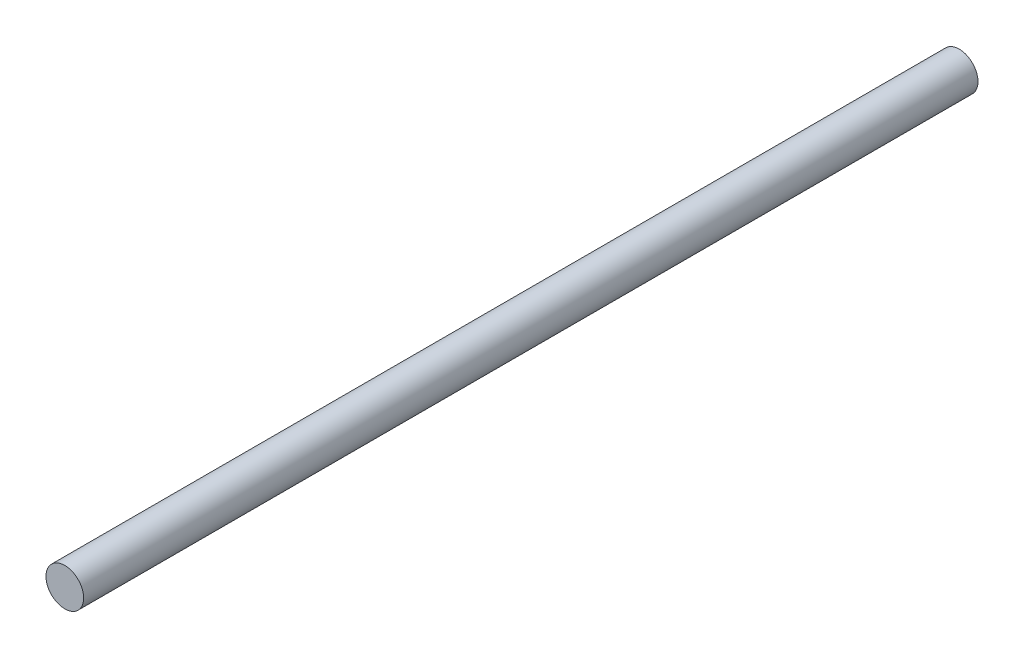
ISO-10303-21;
HEADER;
FILE_DESCRIPTION(('STEP AP214'),'2;1');
FILE_NAME('part.step','',(''),(''),'','','');
FILE_SCHEMA(('AUTOMOTIVE_DESIGN { 1 0 10303 214 1 1 1 1 }'));
ENDSEC;
DATA;
#1=APPLICATION_CONTEXT('core data for automotive mechanical design processes');
#2=APPLICATION_PROTOCOL_DEFINITION('international standard','automotive_design',2000,#1);
#3=PRODUCT_CONTEXT('',#1,'mechanical');
#4=PRODUCT('Part','Part','',(#3));
#5=PRODUCT_RELATED_PRODUCT_CATEGORY('part','',(#4));
#6=PRODUCT_DEFINITION_FORMATION('','',#4);
#7=PRODUCT_DEFINITION_CONTEXT('part definition',#1,'design');
#8=PRODUCT_DEFINITION('design','',#6,#7);
#9=PRODUCT_DEFINITION_SHAPE('','',#8);
#10=(LENGTH_UNIT() NAMED_UNIT(*) SI_UNIT(.MILLI.,.METRE.));
#11=(NAMED_UNIT(*) PLANE_ANGLE_UNIT() SI_UNIT($,.RADIAN.));
#12=(NAMED_UNIT(*) SI_UNIT($,.STERADIAN.) SOLID_ANGLE_UNIT());
#13=UNCERTAINTY_MEASURE_WITH_UNIT(LENGTH_MEASURE(1.E-05),#10,'distance_accuracy_value','');
#14=(GEOMETRIC_REPRESENTATION_CONTEXT(3) GLOBAL_UNCERTAINTY_ASSIGNED_CONTEXT((#13)) GLOBAL_UNIT_ASSIGNED_CONTEXT((#10,
#11,#12)) REPRESENTATION_CONTEXT('',''));
#15=CARTESIAN_POINT('',(0.,0.,0.));
#16=DIRECTION('',(0.,0.,1.));
#17=DIRECTION('',(1.,0.,0.));
#18=AXIS2_PLACEMENT_3D('',#15,#16,#17);
#19=CARTESIAN_POINT('',(0.,62.5,202.));
#20=DIRECTION('',(0.,0.,-1.));
#21=DIRECTION('',(-1.,0.,0.));
#22=AXIS2_PLACEMENT_3D('',#19,#20,#21);
#23=CYLINDRICAL_SURFACE('',#22,4.00000000000001);
#24=CARTESIAN_POINT('',(0.,62.5,202.));
#25=DIRECTION('',(0.,0.,1.));
#26=DIRECTION('',(1.,0.,0.));
#27=AXIS2_PLACEMENT_3D('',#24,#25,#26);
#28=CIRCLE('',#27,4.00000000000001);
#29=CARTESIAN_POINT('',(4.00000000000001,62.5,202.));
#30=VERTEX_POINT('',#29);
#31=EDGE_CURVE('E10',#30,#30,#28,.T.);
#32=ORIENTED_EDGE('',*,*,#31,.F.);
#33=EDGE_LOOP('',(#32));
#34=FACE_BOUND('',#33,.T.);
#35=CARTESIAN_POINT('',(0.,62.5,12.));
#36=DIRECTION('',(0.,0.,1.));
#37=DIRECTION('',(1.,0.,0.));
#38=AXIS2_PLACEMENT_3D('',#35,#36,#37);
#39=CIRCLE('',#38,4.00000000000001);
#40=CARTESIAN_POINT('',(4.00000000000001,62.5,12.));
#41=VERTEX_POINT('',#40);
#42=EDGE_CURVE('E34',#41,#41,#39,.T.);
#43=ORIENTED_EDGE('',*,*,#42,.T.);
#44=EDGE_LOOP('',(#43));
#45=FACE_BOUND('',#44,.T.);
#46=ADVANCED_FACE('F31',(#34,#45),#23,.T.);
#47=CARTESIAN_POINT('',(0.,62.5,202.));
#48=DIRECTION('',(0.,0.,1.));
#49=DIRECTION('',(1.,0.,0.));
#50=AXIS2_PLACEMENT_3D('',#47,#48,#49);
#51=PLANE('',#50);
#52=ORIENTED_EDGE('',*,*,#31,.T.);
#53=EDGE_LOOP('',(#52));
#54=FACE_BOUND('',#53,.T.);
#55=ADVANCED_FACE('F46',(#54),#51,.T.);
#56=CARTESIAN_POINT('',(0.,62.5,12.));
#57=DIRECTION('',(0.,0.,1.));
#58=DIRECTION('',(1.,0.,0.));
#59=AXIS2_PLACEMENT_3D('',#56,#57,#58);
#60=PLANE('',#59);
#61=ORIENTED_EDGE('',*,*,#42,.F.);
#62=EDGE_LOOP('',(#61));
#63=FACE_BOUND('',#62,.T.);
#64=ADVANCED_FACE('F44',(#63),#60,.F.);
#65=CLOSED_SHELL('',(#46,#55,#64));
#66=MANIFOLD_SOLID_BREP('B2',#65);
#67=ADVANCED_BREP_SHAPE_REPRESENTATION('',(#18,#66),#14);
#68=SHAPE_DEFINITION_REPRESENTATION(#9,#67);
ENDSEC;
END-ISO-10303-21;
